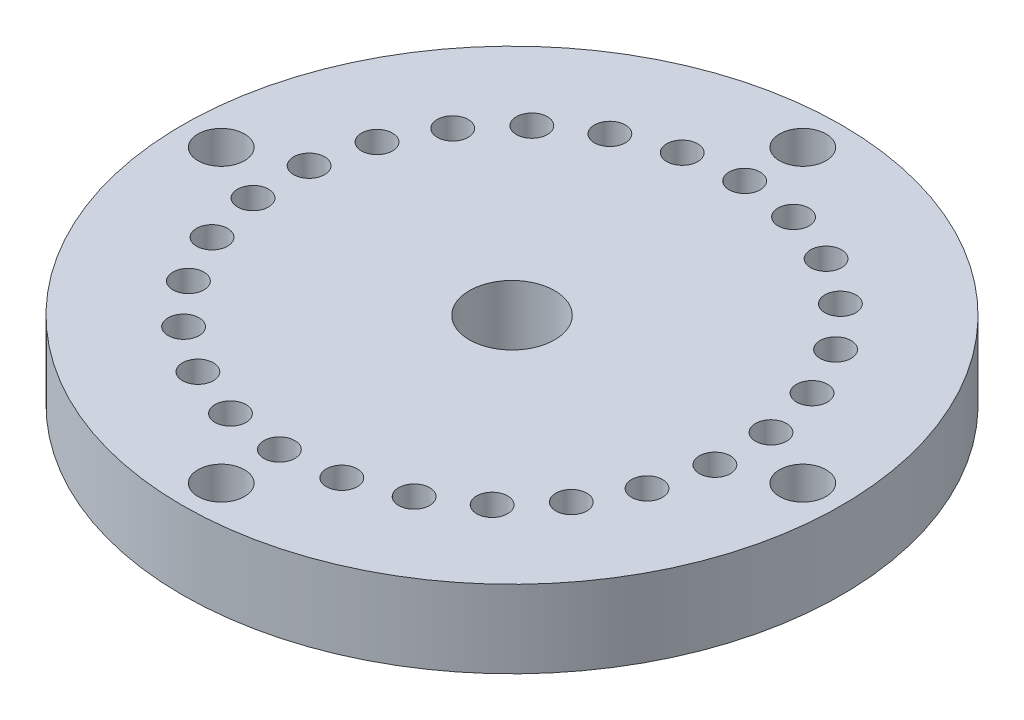
ISO-10303-21;
HEADER;
FILE_DESCRIPTION(('STEP AP214'),'2;1');
FILE_NAME('part.step','',(''),(''),'','','');
FILE_SCHEMA(('AUTOMOTIVE_DESIGN { 1 0 10303 214 1 1 1 1 }'));
ENDSEC;
DATA;
#1=APPLICATION_CONTEXT('core data for automotive mechanical design processes');
#2=APPLICATION_PROTOCOL_DEFINITION('international standard','automotive_design',2000,#1);
#3=PRODUCT_CONTEXT('',#1,'mechanical');
#4=PRODUCT('Part','Part','',(#3));
#5=PRODUCT_RELATED_PRODUCT_CATEGORY('part','',(#4));
#6=PRODUCT_DEFINITION_FORMATION('','',#4);
#7=PRODUCT_DEFINITION_CONTEXT('part definition',#1,'design');
#8=PRODUCT_DEFINITION('design','',#6,#7);
#9=PRODUCT_DEFINITION_SHAPE('','',#8);
#10=(LENGTH_UNIT() NAMED_UNIT(*) SI_UNIT(.MILLI.,.METRE.));
#11=(NAMED_UNIT(*) PLANE_ANGLE_UNIT() SI_UNIT($,.RADIAN.));
#12=(NAMED_UNIT(*) SI_UNIT($,.STERADIAN.) SOLID_ANGLE_UNIT());
#13=UNCERTAINTY_MEASURE_WITH_UNIT(LENGTH_MEASURE(1.E-05),#10,'distance_accuracy_value','');
#14=(GEOMETRIC_REPRESENTATION_CONTEXT(3) GLOBAL_UNCERTAINTY_ASSIGNED_CONTEXT((#13)) GLOBAL_UNIT_ASSIGNED_CONTEXT((#10,
#11,#12)) REPRESENTATION_CONTEXT('',''));
#15=CARTESIAN_POINT('',(0.,0.,0.));
#16=DIRECTION('',(0.,0.,1.));
#17=DIRECTION('',(1.,0.,0.));
#18=AXIS2_PLACEMENT_3D('',#15,#16,#17);
#19=CARTESIAN_POINT('',(0.,1.,0.));
#20=DIRECTION('',(0.,1.,0.));
#21=DIRECTION('',(0.,0.,1.));
#22=AXIS2_PLACEMENT_3D('',#19,#20,#21);
#23=PLANE('',#22);
#24=CARTESIAN_POINT('',(2.1224433562867E-13,1.,3.75));
#25=DIRECTION('',(0.,1.,0.));
#26=DIRECTION('',(0.,0.,1.));
#27=AXIS2_PLACEMENT_3D('',#24,#25,#26);
#28=CIRCLE('',#27,0.300000000000228);
#29=CARTESIAN_POINT('',(2.1224433562867E-13,1.,4.05000000000023));
#30=VERTEX_POINT('',#29);
#31=EDGE_CURVE('E214',#30,#30,#28,.T.);
#32=ORIENTED_EDGE('',*,*,#31,.F.);
#33=EDGE_LOOP('',(#32));
#34=FACE_BOUND('',#33,.T.);
#35=CARTESIAN_POINT('',(-0.717946992862634,1.,-2.91282545227817));
#36=DIRECTION('',(0.,1.,0.));
#37=DIRECTION('',(0.,0.,1.));
#38=AXIS2_PLACEMENT_3D('',#35,#36,#37);
#39=CIRCLE('',#38,0.2);
#40=CARTESIAN_POINT('',(-0.717946992862634,1.,-2.71282545227817));
#41=VERTEX_POINT('',#40);
#42=EDGE_CURVE('E202',#41,#41,#39,.T.);
#43=ORIENTED_EDGE('',*,*,#42,.F.);
#44=EDGE_LOOP('',(#43));
#45=FACE_BOUND('',#44,.T.);
#46=CARTESIAN_POINT('',(-1.98936797472234,1.,-2.24553224451319));
#47=DIRECTION('',(0.,1.,0.));
#48=DIRECTION('',(0.,0.,1.));
#49=AXIS2_PLACEMENT_3D('',#46,#47,#48);
#50=CIRCLE('',#49,0.20000000000011);
#51=CARTESIAN_POINT('',(-1.98936797472234,1.,-2.04553224451308));
#52=VERTEX_POINT('',#51);
#53=EDGE_CURVE('E190',#52,#52,#50,.T.);
#54=ORIENTED_EDGE('',*,*,#53,.F.);
#55=EDGE_LOOP('',(#54));
#56=FACE_BOUND('',#55,.T.);
#57=CARTESIAN_POINT('',(-2.80504872805614,1.,-1.06381466112745));
#58=DIRECTION('',(0.,1.,0.));
#59=DIRECTION('',(0.,0.,1.));
#60=AXIS2_PLACEMENT_3D('',#57,#58,#59);
#61=CIRCLE('',#60,0.200000000000185);
#62=CARTESIAN_POINT('',(-2.80504872805614,1.,-0.863814661127263));
#63=VERTEX_POINT('',#62);
#64=EDGE_CURVE('E178',#63,#63,#61,.T.);
#65=ORIENTED_EDGE('',*,*,#64,.F.);
#66=EDGE_LOOP('',(#65));
#67=FACE_BOUND('',#66,.T.);
#68=CARTESIAN_POINT('',(-2.97812662229397,1.,0.36161004076614));
#69=DIRECTION('',(0.,1.,0.));
#70=DIRECTION('',(0.,0.,1.));
#71=AXIS2_PLACEMENT_3D('',#68,#69,#70);
#72=CIRCLE('',#71,0.200000000000262);
#73=CARTESIAN_POINT('',(-2.97812662229397,1.,0.561610040766402));
#74=VERTEX_POINT('',#73);
#75=EDGE_CURVE('E166',#74,#74,#72,.T.);
#76=ORIENTED_EDGE('',*,*,#75,.F.);
#77=EDGE_LOOP('',(#76));
#78=FACE_BOUND('',#77,.T.);
#79=CARTESIAN_POINT('',(-2.4689515976807,1.,1.70419424019361));
#80=DIRECTION('',(0.,1.,0.));
#81=DIRECTION('',(0.,0.,1.));
#82=AXIS2_PLACEMENT_3D('',#79,#80,#81);
#83=CIRCLE('',#82,0.200000000000322);
#84=CARTESIAN_POINT('',(-2.4689515976807,1.,1.90419424019393));
#85=VERTEX_POINT('',#84);
#86=EDGE_CURVE('E154',#85,#85,#83,.T.);
#87=ORIENTED_EDGE('',*,*,#86,.F.);
#88=EDGE_LOOP('',(#87));
#89=FACE_BOUND('',#88,.T.);
#90=CARTESIAN_POINT('',(-1.39416951613099,1.,2.65636807695971));
#91=DIRECTION('',(0.,1.,0.));
#92=DIRECTION('',(0.,0.,1.));
#93=AXIS2_PLACEMENT_3D('',#90,#91,#92);
#94=CIRCLE('',#93,0.200000000000352);
#95=CARTESIAN_POINT('',(-1.39416951613099,1.,2.85636807696006));
#96=VERTEX_POINT('',#95);
#97=EDGE_CURVE('E142',#96,#96,#94,.T.);
#98=ORIENTED_EDGE('',*,*,#97,.F.);
#99=EDGE_LOOP('',(#98));
#100=FACE_BOUND('',#99,.T.);
#101=CARTESIAN_POINT('',(3.4032572508536E-13,1.,3.));
#102=DIRECTION('',(0.,1.,0.));
#103=DIRECTION('',(0.,0.,1.));
#104=AXIS2_PLACEMENT_3D('',#101,#102,#103);
#105=CIRCLE('',#104,0.200000000000346);
#106=CARTESIAN_POINT('',(3.4032572508536E-13,1.,3.20000000000035));
#107=VERTEX_POINT('',#106);
#108=EDGE_CURVE('E130',#107,#107,#105,.T.);
#109=ORIENTED_EDGE('',*,*,#108,.F.);
#110=EDGE_LOOP('',(#109));
#111=FACE_BOUND('',#110,.T.);
#112=CARTESIAN_POINT('',(1.39416951613163,1.,2.65636807695955));
#113=DIRECTION('',(0.,1.,0.));
#114=DIRECTION('',(0.,0.,1.));
#115=AXIS2_PLACEMENT_3D('',#112,#113,#114);
#116=CIRCLE('',#115,0.200000000000302);
#117=CARTESIAN_POINT('',(1.39416951613163,1.,2.85636807695985));
#118=VERTEX_POINT('',#117);
#119=EDGE_CURVE('E118',#118,#118,#116,.T.);
#120=ORIENTED_EDGE('',*,*,#119,.F.);
#121=EDGE_LOOP('',(#120));
#122=FACE_BOUND('',#121,.T.);
#123=CARTESIAN_POINT('',(2.46895159768124,1.,1.70419424019333));
#124=DIRECTION('',(0.,1.,0.));
#125=DIRECTION('',(0.,0.,1.));
#126=AXIS2_PLACEMENT_3D('',#123,#124,#125);
#127=CIRCLE('',#126,0.200000000000228);
#128=CARTESIAN_POINT('',(2.46895159768124,1.,1.90419424019356));
#129=VERTEX_POINT('',#128);
#130=EDGE_CURVE('E106',#129,#129,#127,.T.);
#131=ORIENTED_EDGE('',*,*,#130,.F.);
#132=EDGE_LOOP('',(#131));
#133=FACE_BOUND('',#132,.T.);
#134=CARTESIAN_POINT('',(2.97812662229435,1.,0.3616100407658));
#135=DIRECTION('',(0.,1.,0.));
#136=DIRECTION('',(0.,0.,1.));
#137=AXIS2_PLACEMENT_3D('',#134,#135,#136);
#138=CIRCLE('',#137,0.200000000000144);
#139=CARTESIAN_POINT('',(2.97812662229435,1.,0.561610040765944));
#140=VERTEX_POINT('',#139);
#141=EDGE_CURVE('E94',#140,#140,#138,.T.);
#142=ORIENTED_EDGE('',*,*,#141,.F.);
#143=EDGE_LOOP('',(#142));
#144=FACE_BOUND('',#143,.T.);
#145=CARTESIAN_POINT('',(2.80504872805635,1.,-1.06381466112777));
#146=DIRECTION('',(0.,1.,0.));
#147=DIRECTION('',(0.,0.,1.));
#148=AXIS2_PLACEMENT_3D('',#145,#146,#147);
#149=CIRCLE('',#148,0.200000000000066);
#150=CARTESIAN_POINT('',(2.80504872805635,1.,-0.8638146611277));
#151=VERTEX_POINT('',#150);
#152=EDGE_CURVE('E82',#151,#151,#149,.T.);
#153=ORIENTED_EDGE('',*,*,#152,.F.);
#154=EDGE_LOOP('',(#153));
#155=FACE_BOUND('',#154,.T.);
#156=CARTESIAN_POINT('',(1.98936797472243,1.,-2.24553224451342));
#157=DIRECTION('',(0.,1.,0.));
#158=DIRECTION('',(0.,0.,1.));
#159=AXIS2_PLACEMENT_3D('',#156,#157,#158);
#160=CIRCLE('',#159,0.200000000000013);
#161=CARTESIAN_POINT('',(1.98936797472243,1.,-2.0455322445134));
#162=VERTEX_POINT('',#161);
#163=EDGE_CURVE('E70',#162,#162,#160,.T.);
#164=ORIENTED_EDGE('',*,*,#163,.F.);
#165=EDGE_LOOP('',(#164));
#166=FACE_BOUND('',#165,.T.);
#167=CARTESIAN_POINT('',(0.717946992862675,1.,-2.91282545227816));
#168=DIRECTION('',(0.,1.,0.));
#169=DIRECTION('',(0.,0.,1.));
#170=AXIS2_PLACEMENT_3D('',#167,#168,#169);
#171=CIRCLE('',#170,0.2);
#172=CARTESIAN_POINT('',(0.717946992862675,1.,-2.71282545227816));
#173=VERTEX_POINT('',#172);
#174=EDGE_CURVE('E58',#173,#173,#171,.T.);
#175=ORIENTED_EDGE('',*,*,#174,.F.);
#176=EDGE_LOOP('',(#175));
#177=FACE_BOUND('',#176,.T.);
#178=CARTESIAN_POINT('',(0.,1.,-3.75));
#179=DIRECTION('',(0.,1.,0.));
#180=DIRECTION('',(0.,0.,1.));
#181=AXIS2_PLACEMENT_3D('',#178,#179,#180);
#182=CIRCLE('',#181,0.3);
#183=CARTESIAN_POINT('',(0.,1.,-3.45));
#184=VERTEX_POINT('',#183);
#185=EDGE_CURVE('E46',#184,#184,#182,.T.);
#186=ORIENTED_EDGE('',*,*,#185,.F.);
#187=EDGE_LOOP('',(#186));
#188=FACE_BOUND('',#187,.T.);
#189=CARTESIAN_POINT('',(0.,1.,0.));
#190=DIRECTION('',(0.,1.,0.));
#191=DIRECTION('',(0.,0.,1.));
#192=AXIS2_PLACEMENT_3D('',#189,#190,#191);
#193=CIRCLE('',#192,4.25);
#194=CARTESIAN_POINT('',(0.,1.,4.25));
#195=VERTEX_POINT('',#194);
#196=EDGE_CURVE('E10',#195,#195,#193,.T.);
#197=ORIENTED_EDGE('',*,*,#196,.T.);
#198=EDGE_LOOP('',(#197));
#199=FACE_BOUND('',#198,.T.);
#200=CARTESIAN_POINT('',(0.,1.,0.));
#201=DIRECTION('',(0.,1.,0.));
#202=DIRECTION('',(0.,0.,1.));
#203=AXIS2_PLACEMENT_3D('',#200,#201,#202);
#204=CIRCLE('',#203,0.55);
#205=CARTESIAN_POINT('',(0.,1.,0.55));
#206=VERTEX_POINT('',#205);
#207=EDGE_CURVE('E41',#206,#206,#204,.T.);
#208=ORIENTED_EDGE('',*,*,#207,.F.);
#209=EDGE_LOOP('',(#208));
#210=FACE_BOUND('',#209,.T.);
#211=CARTESIAN_POINT('',(0.,1.,-3.));
#212=DIRECTION('',(0.,1.,0.));
#213=DIRECTION('',(0.,0.,1.));
#214=AXIS2_PLACEMENT_3D('',#211,#212,#213);
#215=CIRCLE('',#214,0.2);
#216=CARTESIAN_POINT('',(0.,1.,-2.8));
#217=VERTEX_POINT('',#216);
#218=EDGE_CURVE('E52',#217,#217,#215,.T.);
#219=ORIENTED_EDGE('',*,*,#218,.F.);
#220=EDGE_LOOP('',(#219));
#221=FACE_BOUND('',#220,.T.);
#222=CARTESIAN_POINT('',(1.39416951613133,1.,-2.65636807695971));
#223=DIRECTION('',(0.,1.,0.));
#224=DIRECTION('',(0.,0.,1.));
#225=AXIS2_PLACEMENT_3D('',#222,#223,#224);
#226=CIRCLE('',#225,0.199999999999999);
#227=CARTESIAN_POINT('',(1.39416951613133,1.,-2.45636807695971));
#228=VERTEX_POINT('',#227);
#229=EDGE_CURVE('E64',#228,#228,#226,.T.);
#230=ORIENTED_EDGE('',*,*,#229,.F.);
#231=EDGE_LOOP('',(#230));
#232=FACE_BOUND('',#231,.T.);
#233=CARTESIAN_POINT('',(2.46895159768104,1.,-1.70419424019361));
#234=DIRECTION('',(0.,1.,0.));
#235=DIRECTION('',(0.,0.,1.));
#236=AXIS2_PLACEMENT_3D('',#233,#234,#235);
#237=CIRCLE('',#236,0.200000000000036);
#238=CARTESIAN_POINT('',(2.46895159768104,1.,-1.50419424019357));
#239=VERTEX_POINT('',#238);
#240=EDGE_CURVE('E76',#239,#239,#237,.T.);
#241=ORIENTED_EDGE('',*,*,#240,.F.);
#242=EDGE_LOOP('',(#241));
#243=FACE_BOUND('',#242,.T.);
#244=CARTESIAN_POINT('',(2.97812662229431,1.,-0.361610040766138));
#245=DIRECTION('',(0.,1.,0.));
#246=DIRECTION('',(0.,0.,1.));
#247=AXIS2_PLACEMENT_3D('',#244,#245,#246);
#248=CIRCLE('',#247,0.200000000000103);
#249=CARTESIAN_POINT('',(2.97812662229431,1.,-0.161610040766035));
#250=VERTEX_POINT('',#249);
#251=EDGE_CURVE('E88',#250,#250,#248,.T.);
#252=ORIENTED_EDGE('',*,*,#251,.F.);
#253=EDGE_LOOP('',(#252));
#254=FACE_BOUND('',#253,.T.);
#255=CARTESIAN_POINT('',(2.80504872805647,1.,1.06381466112745));
#256=DIRECTION('',(0.,1.,0.));
#257=DIRECTION('',(0.,0.,1.));
#258=AXIS2_PLACEMENT_3D('',#255,#256,#257);
#259=CIRCLE('',#258,0.200000000000187);
#260=CARTESIAN_POINT('',(2.80504872805647,1.,1.26381466112763));
#261=VERTEX_POINT('',#260);
#262=EDGE_CURVE('E100',#261,#261,#259,.T.);
#263=ORIENTED_EDGE('',*,*,#262,.F.);
#264=EDGE_LOOP('',(#263));
#265=FACE_BOUND('',#264,.T.);
#266=CARTESIAN_POINT('',(1.98936797472268,1.,2.24553224451319));
#267=DIRECTION('',(0.,1.,0.));
#268=DIRECTION('',(0.,0.,1.));
#269=AXIS2_PLACEMENT_3D('',#266,#267,#268);
#270=CIRCLE('',#269,0.200000000000268);
#271=CARTESIAN_POINT('',(1.98936797472268,1.,2.44553224451346));
#272=VERTEX_POINT('',#271);
#273=EDGE_CURVE('E112',#272,#272,#270,.T.);
#274=ORIENTED_EDGE('',*,*,#273,.F.);
#275=EDGE_LOOP('',(#274));
#276=FACE_BOUND('',#275,.T.);
#277=CARTESIAN_POINT('',(0.717946992863009,1.,2.91282545227812));
#278=DIRECTION('',(0.,1.,0.));
#279=DIRECTION('',(0.,0.,1.));
#280=AXIS2_PLACEMENT_3D('',#277,#278,#279);
#281=CIRCLE('',#280,0.200000000000327);
#282=CARTESIAN_POINT('',(0.717946992863009,1.,3.11282545227844));
#283=VERTEX_POINT('',#282);
#284=EDGE_CURVE('E124',#283,#283,#281,.T.);
#285=ORIENTED_EDGE('',*,*,#284,.F.);
#286=EDGE_LOOP('',(#285));
#287=FACE_BOUND('',#286,.T.);
#288=CARTESIAN_POINT('',(-0.717946992862337,1.,2.9128254522782));
#289=DIRECTION('',(0.,1.,0.));
#290=DIRECTION('',(0.,0.,1.));
#291=AXIS2_PLACEMENT_3D('',#288,#289,#290);
#292=CIRCLE('',#291,0.200000000000355);
#293=CARTESIAN_POINT('',(-0.717946992862337,1.,3.11282545227855));
#294=VERTEX_POINT('',#293);
#295=EDGE_CURVE('E136',#294,#294,#292,.T.);
#296=ORIENTED_EDGE('',*,*,#295,.F.);
#297=EDGE_LOOP('',(#296));
#298=FACE_BOUND('',#297,.T.);
#299=CARTESIAN_POINT('',(-1.98936797472209,1.,2.24553224451342));
#300=DIRECTION('',(0.,1.,0.));
#301=DIRECTION('',(0.,0.,1.));
#302=AXIS2_PLACEMENT_3D('',#299,#300,#301);
#303=CIRCLE('',#302,0.200000000000342);
#304=CARTESIAN_POINT('',(-1.98936797472209,1.,2.44553224451376));
#305=VERTEX_POINT('',#304);
#306=EDGE_CURVE('E148',#305,#305,#303,.T.);
#307=ORIENTED_EDGE('',*,*,#306,.F.);
#308=EDGE_LOOP('',(#307));
#309=FACE_BOUND('',#308,.T.);
#310=CARTESIAN_POINT('',(-2.80504872805601,1.,1.06381466112777));
#311=DIRECTION('',(0.,1.,0.));
#312=DIRECTION('',(0.,0.,1.));
#313=AXIS2_PLACEMENT_3D('',#310,#311,#312);
#314=CIRCLE('',#313,0.200000000000295);
#315=CARTESIAN_POINT('',(-2.80504872805601,1.,1.26381466112806));
#316=VERTEX_POINT('',#315);
#317=EDGE_CURVE('E160',#316,#316,#314,.T.);
#318=ORIENTED_EDGE('',*,*,#317,.F.);
#319=EDGE_LOOP('',(#318));
#320=FACE_BOUND('',#319,.T.);
#321=CARTESIAN_POINT('',(-2.97812662229401,1.,-0.361610040765798));
#322=DIRECTION('',(0.,1.,0.));
#323=DIRECTION('',(0.,0.,1.));
#324=AXIS2_PLACEMENT_3D('',#321,#322,#323);
#325=CIRCLE('',#324,0.200000000000225);
#326=CARTESIAN_POINT('',(-2.97812662229401,1.,-0.161610040765573));
#327=VERTEX_POINT('',#326);
#328=EDGE_CURVE('E172',#327,#327,#325,.T.);
#329=ORIENTED_EDGE('',*,*,#328,.F.);
#330=EDGE_LOOP('',(#329));
#331=FACE_BOUND('',#330,.T.);
#332=CARTESIAN_POINT('',(-2.4689515976809,1.,-1.70419424019333));
#333=DIRECTION('',(0.,1.,0.));
#334=DIRECTION('',(0.,0.,1.));
#335=AXIS2_PLACEMENT_3D('',#332,#333,#334);
#336=CIRCLE('',#335,0.200000000000147);
#337=CARTESIAN_POINT('',(-2.4689515976809,1.,-1.50419424019318));
#338=VERTEX_POINT('',#337);
#339=EDGE_CURVE('E184',#338,#338,#336,.T.);
#340=ORIENTED_EDGE('',*,*,#339,.F.);
#341=EDGE_LOOP('',(#340));
#342=FACE_BOUND('',#341,.T.);
#343=CARTESIAN_POINT('',(-1.39416951613129,1.,-2.65636807695955));
#344=DIRECTION('',(0.,1.,0.));
#345=DIRECTION('',(0.,0.,1.));
#346=AXIS2_PLACEMENT_3D('',#343,#344,#345);
#347=CIRCLE('',#346,0.20000000000008);
#348=CARTESIAN_POINT('',(-1.39416951613129,1.,-2.45636807695947));
#349=VERTEX_POINT('',#348);
#350=EDGE_CURVE('E196',#349,#349,#347,.T.);
#351=ORIENTED_EDGE('',*,*,#350,.F.);
#352=EDGE_LOOP('',(#351));
#353=FACE_BOUND('',#352,.T.);
#354=CARTESIAN_POINT('',(3.75000000000011,1.,-1.06122167814335E-13));
#355=DIRECTION('',(0.,1.,0.));
#356=DIRECTION('',(0.,0.,1.));
#357=AXIS2_PLACEMENT_3D('',#354,#355,#356);
#358=CIRCLE('',#357,0.300000000000083);
#359=CARTESIAN_POINT('',(3.75000000000011,1.,0.299999999999977));
#360=VERTEX_POINT('',#359);
#361=EDGE_CURVE('E208',#360,#360,#358,.T.);
#362=ORIENTED_EDGE('',*,*,#361,.F.);
#363=EDGE_LOOP('',(#362));
#364=FACE_BOUND('',#363,.T.);
#365=CARTESIAN_POINT('',(-3.74999999999989,1.,1.06581410364015E-13));
#366=DIRECTION('',(0.,1.,0.));
#367=DIRECTION('',(0.,0.,1.));
#368=AXIS2_PLACEMENT_3D('',#365,#366,#367);
#369=CIRCLE('',#368,0.30000000000017);
#370=CARTESIAN_POINT('',(-3.74999999999989,1.,0.300000000000277));
#371=VERTEX_POINT('',#370);
#372=EDGE_CURVE('E220',#371,#371,#369,.T.);
#373=ORIENTED_EDGE('',*,*,#372,.F.);
#374=EDGE_LOOP('',(#373));
#375=FACE_BOUND('',#374,.T.);
#376=ADVANCED_FACE('F30',(#34,#45,#56,#67,#78,#89,#100,#111,#122,#133,#144,#155,#166,#177,#188,
#199,#210,#221,#232,#243,#254,#265,#276,#287,#298,#309,#320,#331,#342,#353,#364,#375),#23,.T.);
#377=CARTESIAN_POINT('',(0.,0.,0.));
#378=DIRECTION('',(0.,1.,0.));
#379=DIRECTION('',(0.,0.,1.));
#380=AXIS2_PLACEMENT_3D('',#377,#378,#379);
#381=PLANE('',#380);
#382=CARTESIAN_POINT('',(2.1224433562867E-13,0.,3.75));
#383=DIRECTION('',(0.,1.,0.));
#384=DIRECTION('',(0.,0.,1.));
#385=AXIS2_PLACEMENT_3D('',#382,#383,#384);
#386=CIRCLE('',#385,0.300000000000228);
#387=CARTESIAN_POINT('',(2.1224433562867E-13,0.,4.05000000000023));
#388=VERTEX_POINT('',#387);
#389=EDGE_CURVE('E217',#388,#388,#386,.T.);
#390=ORIENTED_EDGE('',*,*,#389,.T.);
#391=EDGE_LOOP('',(#390));
#392=FACE_BOUND('',#391,.T.);
#393=CARTESIAN_POINT('',(-0.717946992862634,0.,-2.91282545227817));
#394=DIRECTION('',(0.,1.,0.));
#395=DIRECTION('',(0.,0.,1.));
#396=AXIS2_PLACEMENT_3D('',#393,#394,#395);
#397=CIRCLE('',#396,0.2);
#398=CARTESIAN_POINT('',(-0.717946992862634,0.,-2.71282545227817));
#399=VERTEX_POINT('',#398);
#400=EDGE_CURVE('E205',#399,#399,#397,.T.);
#401=ORIENTED_EDGE('',*,*,#400,.T.);
#402=EDGE_LOOP('',(#401));
#403=FACE_BOUND('',#402,.T.);
#404=CARTESIAN_POINT('',(-1.98936797472234,0.,-2.24553224451319));
#405=DIRECTION('',(0.,1.,0.));
#406=DIRECTION('',(0.,0.,1.));
#407=AXIS2_PLACEMENT_3D('',#404,#405,#406);
#408=CIRCLE('',#407,0.20000000000011);
#409=CARTESIAN_POINT('',(-1.98936797472234,0.,-2.04553224451308));
#410=VERTEX_POINT('',#409);
#411=EDGE_CURVE('E193',#410,#410,#408,.T.);
#412=ORIENTED_EDGE('',*,*,#411,.T.);
#413=EDGE_LOOP('',(#412));
#414=FACE_BOUND('',#413,.T.);
#415=CARTESIAN_POINT('',(-2.80504872805614,0.,-1.06381466112745));
#416=DIRECTION('',(0.,1.,0.));
#417=DIRECTION('',(0.,0.,1.));
#418=AXIS2_PLACEMENT_3D('',#415,#416,#417);
#419=CIRCLE('',#418,0.200000000000185);
#420=CARTESIAN_POINT('',(-2.80504872805614,0.,-0.863814661127263));
#421=VERTEX_POINT('',#420);
#422=EDGE_CURVE('E181',#421,#421,#419,.T.);
#423=ORIENTED_EDGE('',*,*,#422,.T.);
#424=EDGE_LOOP('',(#423));
#425=FACE_BOUND('',#424,.T.);
#426=CARTESIAN_POINT('',(-2.97812662229397,0.,0.36161004076614));
#427=DIRECTION('',(0.,1.,0.));
#428=DIRECTION('',(0.,0.,1.));
#429=AXIS2_PLACEMENT_3D('',#426,#427,#428);
#430=CIRCLE('',#429,0.200000000000262);
#431=CARTESIAN_POINT('',(-2.97812662229397,0.,0.561610040766402));
#432=VERTEX_POINT('',#431);
#433=EDGE_CURVE('E169',#432,#432,#430,.T.);
#434=ORIENTED_EDGE('',*,*,#433,.T.);
#435=EDGE_LOOP('',(#434));
#436=FACE_BOUND('',#435,.T.);
#437=CARTESIAN_POINT('',(-2.4689515976807,0.,1.70419424019361));
#438=DIRECTION('',(0.,1.,0.));
#439=DIRECTION('',(0.,0.,1.));
#440=AXIS2_PLACEMENT_3D('',#437,#438,#439);
#441=CIRCLE('',#440,0.200000000000322);
#442=CARTESIAN_POINT('',(-2.4689515976807,0.,1.90419424019393));
#443=VERTEX_POINT('',#442);
#444=EDGE_CURVE('E157',#443,#443,#441,.T.);
#445=ORIENTED_EDGE('',*,*,#444,.T.);
#446=EDGE_LOOP('',(#445));
#447=FACE_BOUND('',#446,.T.);
#448=CARTESIAN_POINT('',(-1.39416951613099,0.,2.65636807695971));
#449=DIRECTION('',(0.,1.,0.));
#450=DIRECTION('',(0.,0.,1.));
#451=AXIS2_PLACEMENT_3D('',#448,#449,#450);
#452=CIRCLE('',#451,0.200000000000352);
#453=CARTESIAN_POINT('',(-1.39416951613099,0.,2.85636807696006));
#454=VERTEX_POINT('',#453);
#455=EDGE_CURVE('E145',#454,#454,#452,.T.);
#456=ORIENTED_EDGE('',*,*,#455,.T.);
#457=EDGE_LOOP('',(#456));
#458=FACE_BOUND('',#457,.T.);
#459=CARTESIAN_POINT('',(3.4032572508536E-13,0.,3.));
#460=DIRECTION('',(0.,1.,0.));
#461=DIRECTION('',(0.,0.,1.));
#462=AXIS2_PLACEMENT_3D('',#459,#460,#461);
#463=CIRCLE('',#462,0.200000000000346);
#464=CARTESIAN_POINT('',(3.4032572508536E-13,0.,3.20000000000035));
#465=VERTEX_POINT('',#464);
#466=EDGE_CURVE('E133',#465,#465,#463,.T.);
#467=ORIENTED_EDGE('',*,*,#466,.T.);
#468=EDGE_LOOP('',(#467));
#469=FACE_BOUND('',#468,.T.);
#470=CARTESIAN_POINT('',(1.39416951613163,0.,2.65636807695955));
#471=DIRECTION('',(0.,1.,0.));
#472=DIRECTION('',(0.,0.,1.));
#473=AXIS2_PLACEMENT_3D('',#470,#471,#472);
#474=CIRCLE('',#473,0.200000000000302);
#475=CARTESIAN_POINT('',(1.39416951613163,0.,2.85636807695985));
#476=VERTEX_POINT('',#475);
#477=EDGE_CURVE('E121',#476,#476,#474,.T.);
#478=ORIENTED_EDGE('',*,*,#477,.T.);
#479=EDGE_LOOP('',(#478));
#480=FACE_BOUND('',#479,.T.);
#481=CARTESIAN_POINT('',(2.46895159768124,0.,1.70419424019333));
#482=DIRECTION('',(0.,1.,0.));
#483=DIRECTION('',(0.,0.,1.));
#484=AXIS2_PLACEMENT_3D('',#481,#482,#483);
#485=CIRCLE('',#484,0.200000000000228);
#486=CARTESIAN_POINT('',(2.46895159768124,0.,1.90419424019356));
#487=VERTEX_POINT('',#486);
#488=EDGE_CURVE('E109',#487,#487,#485,.T.);
#489=ORIENTED_EDGE('',*,*,#488,.T.);
#490=EDGE_LOOP('',(#489));
#491=FACE_BOUND('',#490,.T.);
#492=CARTESIAN_POINT('',(2.97812662229435,0.,0.3616100407658));
#493=DIRECTION('',(0.,1.,0.));
#494=DIRECTION('',(0.,0.,1.));
#495=AXIS2_PLACEMENT_3D('',#492,#493,#494);
#496=CIRCLE('',#495,0.200000000000144);
#497=CARTESIAN_POINT('',(2.97812662229435,0.,0.561610040765944));
#498=VERTEX_POINT('',#497);
#499=EDGE_CURVE('E97',#498,#498,#496,.T.);
#500=ORIENTED_EDGE('',*,*,#499,.T.);
#501=EDGE_LOOP('',(#500));
#502=FACE_BOUND('',#501,.T.);
#503=CARTESIAN_POINT('',(2.80504872805635,0.,-1.06381466112777));
#504=DIRECTION('',(0.,1.,0.));
#505=DIRECTION('',(0.,0.,1.));
#506=AXIS2_PLACEMENT_3D('',#503,#504,#505);
#507=CIRCLE('',#506,0.200000000000066);
#508=CARTESIAN_POINT('',(2.80504872805635,0.,-0.8638146611277));
#509=VERTEX_POINT('',#508);
#510=EDGE_CURVE('E85',#509,#509,#507,.T.);
#511=ORIENTED_EDGE('',*,*,#510,.T.);
#512=EDGE_LOOP('',(#511));
#513=FACE_BOUND('',#512,.T.);
#514=CARTESIAN_POINT('',(1.98936797472243,0.,-2.24553224451342));
#515=DIRECTION('',(0.,1.,0.));
#516=DIRECTION('',(0.,0.,1.));
#517=AXIS2_PLACEMENT_3D('',#514,#515,#516);
#518=CIRCLE('',#517,0.200000000000013);
#519=CARTESIAN_POINT('',(1.98936797472243,0.,-2.0455322445134));
#520=VERTEX_POINT('',#519);
#521=EDGE_CURVE('E73',#520,#520,#518,.T.);
#522=ORIENTED_EDGE('',*,*,#521,.T.);
#523=EDGE_LOOP('',(#522));
#524=FACE_BOUND('',#523,.T.);
#525=CARTESIAN_POINT('',(0.717946992862675,0.,-2.91282545227816));
#526=DIRECTION('',(0.,1.,0.));
#527=DIRECTION('',(0.,0.,1.));
#528=AXIS2_PLACEMENT_3D('',#525,#526,#527);
#529=CIRCLE('',#528,0.2);
#530=CARTESIAN_POINT('',(0.717946992862675,0.,-2.71282545227816));
#531=VERTEX_POINT('',#530);
#532=EDGE_CURVE('E61',#531,#531,#529,.T.);
#533=ORIENTED_EDGE('',*,*,#532,.T.);
#534=EDGE_LOOP('',(#533));
#535=FACE_BOUND('',#534,.T.);
#536=CARTESIAN_POINT('',(0.,0.,-3.75));
#537=DIRECTION('',(0.,1.,0.));
#538=DIRECTION('',(0.,0.,1.));
#539=AXIS2_PLACEMENT_3D('',#536,#537,#538);
#540=CIRCLE('',#539,0.3);
#541=CARTESIAN_POINT('',(0.,0.,-3.45));
#542=VERTEX_POINT('',#541);
#543=EDGE_CURVE('E49',#542,#542,#540,.T.);
#544=ORIENTED_EDGE('',*,*,#543,.T.);
#545=EDGE_LOOP('',(#544));
#546=FACE_BOUND('',#545,.T.);
#547=CARTESIAN_POINT('',(0.,0.,0.));
#548=DIRECTION('',(0.,1.,0.));
#549=DIRECTION('',(0.,0.,1.));
#550=AXIS2_PLACEMENT_3D('',#547,#548,#549);
#551=CIRCLE('',#550,4.25);
#552=CARTESIAN_POINT('',(0.,0.,4.25));
#553=VERTEX_POINT('',#552);
#554=EDGE_CURVE('E34',#553,#553,#551,.T.);
#555=ORIENTED_EDGE('',*,*,#554,.F.);
#556=EDGE_LOOP('',(#555));
#557=FACE_BOUND('',#556,.T.);
#558=CARTESIAN_POINT('',(0.,0.,0.));
#559=DIRECTION('',(0.,1.,0.));
#560=DIRECTION('',(0.,0.,1.));
#561=AXIS2_PLACEMENT_3D('',#558,#559,#560);
#562=CIRCLE('',#561,0.55);
#563=CARTESIAN_POINT('',(0.,0.,0.55));
#564=VERTEX_POINT('',#563);
#565=EDGE_CURVE('E43',#564,#564,#562,.T.);
#566=ORIENTED_EDGE('',*,*,#565,.T.);
#567=EDGE_LOOP('',(#566));
#568=FACE_BOUND('',#567,.T.);
#569=CARTESIAN_POINT('',(0.,0.,-3.));
#570=DIRECTION('',(0.,1.,0.));
#571=DIRECTION('',(0.,0.,1.));
#572=AXIS2_PLACEMENT_3D('',#569,#570,#571);
#573=CIRCLE('',#572,0.2);
#574=CARTESIAN_POINT('',(0.,0.,-2.8));
#575=VERTEX_POINT('',#574);
#576=EDGE_CURVE('E55',#575,#575,#573,.T.);
#577=ORIENTED_EDGE('',*,*,#576,.T.);
#578=EDGE_LOOP('',(#577));
#579=FACE_BOUND('',#578,.T.);
#580=CARTESIAN_POINT('',(1.39416951613133,0.,-2.65636807695971));
#581=DIRECTION('',(0.,1.,0.));
#582=DIRECTION('',(0.,0.,1.));
#583=AXIS2_PLACEMENT_3D('',#580,#581,#582);
#584=CIRCLE('',#583,0.199999999999999);
#585=CARTESIAN_POINT('',(1.39416951613133,0.,-2.45636807695971));
#586=VERTEX_POINT('',#585);
#587=EDGE_CURVE('E67',#586,#586,#584,.T.);
#588=ORIENTED_EDGE('',*,*,#587,.T.);
#589=EDGE_LOOP('',(#588));
#590=FACE_BOUND('',#589,.T.);
#591=CARTESIAN_POINT('',(2.46895159768104,0.,-1.70419424019361));
#592=DIRECTION('',(0.,1.,0.));
#593=DIRECTION('',(0.,0.,1.));
#594=AXIS2_PLACEMENT_3D('',#591,#592,#593);
#595=CIRCLE('',#594,0.200000000000036);
#596=CARTESIAN_POINT('',(2.46895159768104,0.,-1.50419424019357));
#597=VERTEX_POINT('',#596);
#598=EDGE_CURVE('E79',#597,#597,#595,.T.);
#599=ORIENTED_EDGE('',*,*,#598,.T.);
#600=EDGE_LOOP('',(#599));
#601=FACE_BOUND('',#600,.T.);
#602=CARTESIAN_POINT('',(2.97812662229431,0.,-0.361610040766138));
#603=DIRECTION('',(0.,1.,0.));
#604=DIRECTION('',(0.,0.,1.));
#605=AXIS2_PLACEMENT_3D('',#602,#603,#604);
#606=CIRCLE('',#605,0.200000000000103);
#607=CARTESIAN_POINT('',(2.97812662229431,0.,-0.161610040766035));
#608=VERTEX_POINT('',#607);
#609=EDGE_CURVE('E91',#608,#608,#606,.T.);
#610=ORIENTED_EDGE('',*,*,#609,.T.);
#611=EDGE_LOOP('',(#610));
#612=FACE_BOUND('',#611,.T.);
#613=CARTESIAN_POINT('',(2.80504872805647,0.,1.06381466112745));
#614=DIRECTION('',(0.,1.,0.));
#615=DIRECTION('',(0.,0.,1.));
#616=AXIS2_PLACEMENT_3D('',#613,#614,#615);
#617=CIRCLE('',#616,0.200000000000187);
#618=CARTESIAN_POINT('',(2.80504872805647,0.,1.26381466112763));
#619=VERTEX_POINT('',#618);
#620=EDGE_CURVE('E103',#619,#619,#617,.T.);
#621=ORIENTED_EDGE('',*,*,#620,.T.);
#622=EDGE_LOOP('',(#621));
#623=FACE_BOUND('',#622,.T.);
#624=CARTESIAN_POINT('',(1.98936797472268,0.,2.24553224451319));
#625=DIRECTION('',(0.,1.,0.));
#626=DIRECTION('',(0.,0.,1.));
#627=AXIS2_PLACEMENT_3D('',#624,#625,#626);
#628=CIRCLE('',#627,0.200000000000268);
#629=CARTESIAN_POINT('',(1.98936797472268,0.,2.44553224451346));
#630=VERTEX_POINT('',#629);
#631=EDGE_CURVE('E115',#630,#630,#628,.T.);
#632=ORIENTED_EDGE('',*,*,#631,.T.);
#633=EDGE_LOOP('',(#632));
#634=FACE_BOUND('',#633,.T.);
#635=CARTESIAN_POINT('',(0.717946992863009,0.,2.91282545227812));
#636=DIRECTION('',(0.,1.,0.));
#637=DIRECTION('',(0.,0.,1.));
#638=AXIS2_PLACEMENT_3D('',#635,#636,#637);
#639=CIRCLE('',#638,0.200000000000327);
#640=CARTESIAN_POINT('',(0.717946992863009,0.,3.11282545227844));
#641=VERTEX_POINT('',#640);
#642=EDGE_CURVE('E127',#641,#641,#639,.T.);
#643=ORIENTED_EDGE('',*,*,#642,.T.);
#644=EDGE_LOOP('',(#643));
#645=FACE_BOUND('',#644,.T.);
#646=CARTESIAN_POINT('',(-0.717946992862337,0.,2.9128254522782));
#647=DIRECTION('',(0.,1.,0.));
#648=DIRECTION('',(0.,0.,1.));
#649=AXIS2_PLACEMENT_3D('',#646,#647,#648);
#650=CIRCLE('',#649,0.200000000000355);
#651=CARTESIAN_POINT('',(-0.717946992862337,0.,3.11282545227855));
#652=VERTEX_POINT('',#651);
#653=EDGE_CURVE('E139',#652,#652,#650,.T.);
#654=ORIENTED_EDGE('',*,*,#653,.T.);
#655=EDGE_LOOP('',(#654));
#656=FACE_BOUND('',#655,.T.);
#657=CARTESIAN_POINT('',(-1.98936797472209,0.,2.24553224451342));
#658=DIRECTION('',(0.,1.,0.));
#659=DIRECTION('',(0.,0.,1.));
#660=AXIS2_PLACEMENT_3D('',#657,#658,#659);
#661=CIRCLE('',#660,0.200000000000342);
#662=CARTESIAN_POINT('',(-1.98936797472209,0.,2.44553224451376));
#663=VERTEX_POINT('',#662);
#664=EDGE_CURVE('E151',#663,#663,#661,.T.);
#665=ORIENTED_EDGE('',*,*,#664,.T.);
#666=EDGE_LOOP('',(#665));
#667=FACE_BOUND('',#666,.T.);
#668=CARTESIAN_POINT('',(-2.80504872805601,0.,1.06381466112777));
#669=DIRECTION('',(0.,1.,0.));
#670=DIRECTION('',(0.,0.,1.));
#671=AXIS2_PLACEMENT_3D('',#668,#669,#670);
#672=CIRCLE('',#671,0.200000000000295);
#673=CARTESIAN_POINT('',(-2.80504872805601,0.,1.26381466112806));
#674=VERTEX_POINT('',#673);
#675=EDGE_CURVE('E163',#674,#674,#672,.T.);
#676=ORIENTED_EDGE('',*,*,#675,.T.);
#677=EDGE_LOOP('',(#676));
#678=FACE_BOUND('',#677,.T.);
#679=CARTESIAN_POINT('',(-2.97812662229401,0.,-0.361610040765798));
#680=DIRECTION('',(0.,1.,0.));
#681=DIRECTION('',(0.,0.,1.));
#682=AXIS2_PLACEMENT_3D('',#679,#680,#681);
#683=CIRCLE('',#682,0.200000000000225);
#684=CARTESIAN_POINT('',(-2.97812662229401,0.,-0.161610040765573));
#685=VERTEX_POINT('',#684);
#686=EDGE_CURVE('E175',#685,#685,#683,.T.);
#687=ORIENTED_EDGE('',*,*,#686,.T.);
#688=EDGE_LOOP('',(#687));
#689=FACE_BOUND('',#688,.T.);
#690=CARTESIAN_POINT('',(-2.4689515976809,0.,-1.70419424019333));
#691=DIRECTION('',(0.,1.,0.));
#692=DIRECTION('',(0.,0.,1.));
#693=AXIS2_PLACEMENT_3D('',#690,#691,#692);
#694=CIRCLE('',#693,0.200000000000147);
#695=CARTESIAN_POINT('',(-2.4689515976809,0.,-1.50419424019318));
#696=VERTEX_POINT('',#695);
#697=EDGE_CURVE('E187',#696,#696,#694,.T.);
#698=ORIENTED_EDGE('',*,*,#697,.T.);
#699=EDGE_LOOP('',(#698));
#700=FACE_BOUND('',#699,.T.);
#701=CARTESIAN_POINT('',(-1.39416951613129,0.,-2.65636807695955));
#702=DIRECTION('',(0.,1.,0.));
#703=DIRECTION('',(0.,0.,1.));
#704=AXIS2_PLACEMENT_3D('',#701,#702,#703);
#705=CIRCLE('',#704,0.20000000000008);
#706=CARTESIAN_POINT('',(-1.39416951613129,0.,-2.45636807695947));
#707=VERTEX_POINT('',#706);
#708=EDGE_CURVE('E199',#707,#707,#705,.T.);
#709=ORIENTED_EDGE('',*,*,#708,.T.);
#710=EDGE_LOOP('',(#709));
#711=FACE_BOUND('',#710,.T.);
#712=CARTESIAN_POINT('',(3.75000000000011,0.,-1.06122167814335E-13));
#713=DIRECTION('',(0.,1.,0.));
#714=DIRECTION('',(0.,0.,1.));
#715=AXIS2_PLACEMENT_3D('',#712,#713,#714);
#716=CIRCLE('',#715,0.300000000000083);
#717=CARTESIAN_POINT('',(3.75000000000011,0.,0.299999999999977));
#718=VERTEX_POINT('',#717);
#719=EDGE_CURVE('E211',#718,#718,#716,.T.);
#720=ORIENTED_EDGE('',*,*,#719,.T.);
#721=EDGE_LOOP('',(#720));
#722=FACE_BOUND('',#721,.T.);
#723=CARTESIAN_POINT('',(-3.74999999999989,0.,1.06581410364015E-13));
#724=DIRECTION('',(0.,1.,0.));
#725=DIRECTION('',(0.,0.,1.));
#726=AXIS2_PLACEMENT_3D('',#723,#724,#725);
#727=CIRCLE('',#726,0.30000000000017);
#728=CARTESIAN_POINT('',(-3.74999999999989,0.,0.300000000000277));
#729=VERTEX_POINT('',#728);
#730=EDGE_CURVE('E223',#729,#729,#727,.T.);
#731=ORIENTED_EDGE('',*,*,#730,.T.);
#732=EDGE_LOOP('',(#731));
#733=FACE_BOUND('',#732,.T.);
#734=ADVANCED_FACE('F233',(#392,#403,#414,#425,#436,#447,#458,#469,#480,#491,#502,#513,#524,
#535,#546,#557,#568,#579,#590,#601,#612,#623,#634,#645,#656,#667,#678,#689,#700,#711,#722,#733),
#381,.F.);
#735=CARTESIAN_POINT('',(0.,1.,0.));
#736=DIRECTION('',(0.,-1.,0.));
#737=DIRECTION('',(0.,0.,-1.));
#738=AXIS2_PLACEMENT_3D('',#735,#736,#737);
#739=CYLINDRICAL_SURFACE('',#738,4.25);
#740=ORIENTED_EDGE('',*,*,#196,.F.);
#741=EDGE_LOOP('',(#740));
#742=FACE_BOUND('',#741,.T.);
#743=ORIENTED_EDGE('',*,*,#554,.T.);
#744=EDGE_LOOP('',(#743));
#745=FACE_BOUND('',#744,.T.);
#746=ADVANCED_FACE('F32',(#742,#745),#739,.T.);
#747=CARTESIAN_POINT('',(0.,1.,0.));
#748=DIRECTION('',(0.,-1.,0.));
#749=DIRECTION('',(0.,0.,-1.));
#750=AXIS2_PLACEMENT_3D('',#747,#748,#749);
#751=CYLINDRICAL_SURFACE('',#750,0.55);
#752=ORIENTED_EDGE('',*,*,#207,.T.);
#753=EDGE_LOOP('',(#752));
#754=FACE_BOUND('',#753,.T.);
#755=ORIENTED_EDGE('',*,*,#565,.F.);
#756=EDGE_LOOP('',(#755));
#757=FACE_BOUND('',#756,.T.);
#758=ADVANCED_FACE('F243',(#754,#757),#751,.F.);
#759=CARTESIAN_POINT('',(0.,1.,-3.75));
#760=DIRECTION('',(0.,-1.,0.));
#761=DIRECTION('',(0.,0.,-1.));
#762=AXIS2_PLACEMENT_3D('',#759,#760,#761);
#763=CYLINDRICAL_SURFACE('',#762,0.3);
#764=ORIENTED_EDGE('',*,*,#185,.T.);
#765=EDGE_LOOP('',(#764));
#766=FACE_BOUND('',#765,.T.);
#767=ORIENTED_EDGE('',*,*,#543,.F.);
#768=EDGE_LOOP('',(#767));
#769=FACE_BOUND('',#768,.T.);
#770=ADVANCED_FACE('F246',(#766,#769),#763,.F.);
#771=CARTESIAN_POINT('',(0.,1.,-3.));
#772=DIRECTION('',(0.,-1.,0.));
#773=DIRECTION('',(0.,0.,-1.));
#774=AXIS2_PLACEMENT_3D('',#771,#772,#773);
#775=CYLINDRICAL_SURFACE('',#774,0.2);
#776=ORIENTED_EDGE('',*,*,#218,.T.);
#777=EDGE_LOOP('',(#776));
#778=FACE_BOUND('',#777,.T.);
#779=ORIENTED_EDGE('',*,*,#576,.F.);
#780=EDGE_LOOP('',(#779));
#781=FACE_BOUND('',#780,.T.);
#782=ADVANCED_FACE('F250',(#778,#781),#775,.F.);
#783=CARTESIAN_POINT('',(0.717946992862675,1.,-2.91282545227816));
#784=DIRECTION('',(0.,-1.,0.));
#785=DIRECTION('',(0.,0.,-1.));
#786=AXIS2_PLACEMENT_3D('',#783,#784,#785);
#787=CYLINDRICAL_SURFACE('',#786,0.2);
#788=ORIENTED_EDGE('',*,*,#174,.T.);
#789=EDGE_LOOP('',(#788));
#790=FACE_BOUND('',#789,.T.);
#791=ORIENTED_EDGE('',*,*,#532,.F.);
#792=EDGE_LOOP('',(#791));
#793=FACE_BOUND('',#792,.T.);
#794=ADVANCED_FACE('F254',(#790,#793),#787,.F.);
#795=CARTESIAN_POINT('',(1.39416951613133,1.,-2.65636807695971));
#796=DIRECTION('',(0.,-1.,0.));
#797=DIRECTION('',(0.,0.,-1.));
#798=AXIS2_PLACEMENT_3D('',#795,#796,#797);
#799=CYLINDRICAL_SURFACE('',#798,0.199999999999999);
#800=ORIENTED_EDGE('',*,*,#229,.T.);
#801=EDGE_LOOP('',(#800));
#802=FACE_BOUND('',#801,.T.);
#803=ORIENTED_EDGE('',*,*,#587,.F.);
#804=EDGE_LOOP('',(#803));
#805=FACE_BOUND('',#804,.T.);
#806=ADVANCED_FACE('F258',(#802,#805),#799,.F.);
#807=CARTESIAN_POINT('',(1.98936797472243,1.,-2.24553224451342));
#808=DIRECTION('',(0.,-1.,0.));
#809=DIRECTION('',(0.,0.,-1.));
#810=AXIS2_PLACEMENT_3D('',#807,#808,#809);
#811=CYLINDRICAL_SURFACE('',#810,0.200000000000013);
#812=ORIENTED_EDGE('',*,*,#163,.T.);
#813=EDGE_LOOP('',(#812));
#814=FACE_BOUND('',#813,.T.);
#815=ORIENTED_EDGE('',*,*,#521,.F.);
#816=EDGE_LOOP('',(#815));
#817=FACE_BOUND('',#816,.T.);
#818=ADVANCED_FACE('F262',(#814,#817),#811,.F.);
#819=CARTESIAN_POINT('',(2.46895159768104,1.,-1.70419424019361));
#820=DIRECTION('',(0.,-1.,0.));
#821=DIRECTION('',(0.,0.,-1.));
#822=AXIS2_PLACEMENT_3D('',#819,#820,#821);
#823=CYLINDRICAL_SURFACE('',#822,0.200000000000036);
#824=ORIENTED_EDGE('',*,*,#240,.T.);
#825=EDGE_LOOP('',(#824));
#826=FACE_BOUND('',#825,.T.);
#827=ORIENTED_EDGE('',*,*,#598,.F.);
#828=EDGE_LOOP('',(#827));
#829=FACE_BOUND('',#828,.T.);
#830=ADVANCED_FACE('F266',(#826,#829),#823,.F.);
#831=CARTESIAN_POINT('',(2.80504872805635,1.,-1.06381466112777));
#832=DIRECTION('',(0.,-1.,0.));
#833=DIRECTION('',(0.,0.,-1.));
#834=AXIS2_PLACEMENT_3D('',#831,#832,#833);
#835=CYLINDRICAL_SURFACE('',#834,0.200000000000066);
#836=ORIENTED_EDGE('',*,*,#152,.T.);
#837=EDGE_LOOP('',(#836));
#838=FACE_BOUND('',#837,.T.);
#839=ORIENTED_EDGE('',*,*,#510,.F.);
#840=EDGE_LOOP('',(#839));
#841=FACE_BOUND('',#840,.T.);
#842=ADVANCED_FACE('F270',(#838,#841),#835,.F.);
#843=CARTESIAN_POINT('',(2.97812662229431,1.,-0.361610040766138));
#844=DIRECTION('',(0.,-1.,0.));
#845=DIRECTION('',(0.,0.,-1.));
#846=AXIS2_PLACEMENT_3D('',#843,#844,#845);
#847=CYLINDRICAL_SURFACE('',#846,0.200000000000103);
#848=ORIENTED_EDGE('',*,*,#251,.T.);
#849=EDGE_LOOP('',(#848));
#850=FACE_BOUND('',#849,.T.);
#851=ORIENTED_EDGE('',*,*,#609,.F.);
#852=EDGE_LOOP('',(#851));
#853=FACE_BOUND('',#852,.T.);
#854=ADVANCED_FACE('F274',(#850,#853),#847,.F.);
#855=CARTESIAN_POINT('',(2.97812662229435,1.,0.3616100407658));
#856=DIRECTION('',(0.,-1.,0.));
#857=DIRECTION('',(0.,0.,-1.));
#858=AXIS2_PLACEMENT_3D('',#855,#856,#857);
#859=CYLINDRICAL_SURFACE('',#858,0.200000000000144);
#860=ORIENTED_EDGE('',*,*,#141,.T.);
#861=EDGE_LOOP('',(#860));
#862=FACE_BOUND('',#861,.T.);
#863=ORIENTED_EDGE('',*,*,#499,.F.);
#864=EDGE_LOOP('',(#863));
#865=FACE_BOUND('',#864,.T.);
#866=ADVANCED_FACE('F278',(#862,#865),#859,.F.);
#867=CARTESIAN_POINT('',(2.80504872805647,1.,1.06381466112745));
#868=DIRECTION('',(0.,-1.,0.));
#869=DIRECTION('',(0.,0.,-1.));
#870=AXIS2_PLACEMENT_3D('',#867,#868,#869);
#871=CYLINDRICAL_SURFACE('',#870,0.200000000000187);
#872=ORIENTED_EDGE('',*,*,#262,.T.);
#873=EDGE_LOOP('',(#872));
#874=FACE_BOUND('',#873,.T.);
#875=ORIENTED_EDGE('',*,*,#620,.F.);
#876=EDGE_LOOP('',(#875));
#877=FACE_BOUND('',#876,.T.);
#878=ADVANCED_FACE('F282',(#874,#877),#871,.F.);
#879=CARTESIAN_POINT('',(2.46895159768124,1.,1.70419424019333));
#880=DIRECTION('',(0.,-1.,0.));
#881=DIRECTION('',(0.,0.,-1.));
#882=AXIS2_PLACEMENT_3D('',#879,#880,#881);
#883=CYLINDRICAL_SURFACE('',#882,0.200000000000228);
#884=ORIENTED_EDGE('',*,*,#130,.T.);
#885=EDGE_LOOP('',(#884));
#886=FACE_BOUND('',#885,.T.);
#887=ORIENTED_EDGE('',*,*,#488,.F.);
#888=EDGE_LOOP('',(#887));
#889=FACE_BOUND('',#888,.T.);
#890=ADVANCED_FACE('F286',(#886,#889),#883,.F.);
#891=CARTESIAN_POINT('',(1.98936797472268,1.,2.24553224451319));
#892=DIRECTION('',(0.,-1.,0.));
#893=DIRECTION('',(0.,0.,-1.));
#894=AXIS2_PLACEMENT_3D('',#891,#892,#893);
#895=CYLINDRICAL_SURFACE('',#894,0.200000000000268);
#896=ORIENTED_EDGE('',*,*,#273,.T.);
#897=EDGE_LOOP('',(#896));
#898=FACE_BOUND('',#897,.T.);
#899=ORIENTED_EDGE('',*,*,#631,.F.);
#900=EDGE_LOOP('',(#899));
#901=FACE_BOUND('',#900,.T.);
#902=ADVANCED_FACE('F290',(#898,#901),#895,.F.);
#903=CARTESIAN_POINT('',(1.39416951613163,1.,2.65636807695955));
#904=DIRECTION('',(0.,-1.,0.));
#905=DIRECTION('',(0.,0.,-1.));
#906=AXIS2_PLACEMENT_3D('',#903,#904,#905);
#907=CYLINDRICAL_SURFACE('',#906,0.200000000000302);
#908=ORIENTED_EDGE('',*,*,#119,.T.);
#909=EDGE_LOOP('',(#908));
#910=FACE_BOUND('',#909,.T.);
#911=ORIENTED_EDGE('',*,*,#477,.F.);
#912=EDGE_LOOP('',(#911));
#913=FACE_BOUND('',#912,.T.);
#914=ADVANCED_FACE('F294',(#910,#913),#907,.F.);
#915=CARTESIAN_POINT('',(0.717946992863009,1.,2.91282545227812));
#916=DIRECTION('',(0.,-1.,0.));
#917=DIRECTION('',(0.,0.,-1.));
#918=AXIS2_PLACEMENT_3D('',#915,#916,#917);
#919=CYLINDRICAL_SURFACE('',#918,0.200000000000327);
#920=ORIENTED_EDGE('',*,*,#284,.T.);
#921=EDGE_LOOP('',(#920));
#922=FACE_BOUND('',#921,.T.);
#923=ORIENTED_EDGE('',*,*,#642,.F.);
#924=EDGE_LOOP('',(#923));
#925=FACE_BOUND('',#924,.T.);
#926=ADVANCED_FACE('F298',(#922,#925),#919,.F.);
#927=CARTESIAN_POINT('',(3.4032572508536E-13,1.,3.));
#928=DIRECTION('',(0.,-1.,0.));
#929=DIRECTION('',(0.,0.,-1.));
#930=AXIS2_PLACEMENT_3D('',#927,#928,#929);
#931=CYLINDRICAL_SURFACE('',#930,0.200000000000346);
#932=ORIENTED_EDGE('',*,*,#108,.T.);
#933=EDGE_LOOP('',(#932));
#934=FACE_BOUND('',#933,.T.);
#935=ORIENTED_EDGE('',*,*,#466,.F.);
#936=EDGE_LOOP('',(#935));
#937=FACE_BOUND('',#936,.T.);
#938=ADVANCED_FACE('F302',(#934,#937),#931,.F.);
#939=CARTESIAN_POINT('',(-0.717946992862337,1.,2.9128254522782));
#940=DIRECTION('',(0.,-1.,0.));
#941=DIRECTION('',(0.,0.,-1.));
#942=AXIS2_PLACEMENT_3D('',#939,#940,#941);
#943=CYLINDRICAL_SURFACE('',#942,0.200000000000355);
#944=ORIENTED_EDGE('',*,*,#295,.T.);
#945=EDGE_LOOP('',(#944));
#946=FACE_BOUND('',#945,.T.);
#947=ORIENTED_EDGE('',*,*,#653,.F.);
#948=EDGE_LOOP('',(#947));
#949=FACE_BOUND('',#948,.T.);
#950=ADVANCED_FACE('F306',(#946,#949),#943,.F.);
#951=CARTESIAN_POINT('',(-1.39416951613099,1.,2.65636807695971));
#952=DIRECTION('',(0.,-1.,0.));
#953=DIRECTION('',(0.,0.,-1.));
#954=AXIS2_PLACEMENT_3D('',#951,#952,#953);
#955=CYLINDRICAL_SURFACE('',#954,0.200000000000352);
#956=ORIENTED_EDGE('',*,*,#97,.T.);
#957=EDGE_LOOP('',(#956));
#958=FACE_BOUND('',#957,.T.);
#959=ORIENTED_EDGE('',*,*,#455,.F.);
#960=EDGE_LOOP('',(#959));
#961=FACE_BOUND('',#960,.T.);
#962=ADVANCED_FACE('F310',(#958,#961),#955,.F.);
#963=CARTESIAN_POINT('',(-1.98936797472209,1.,2.24553224451342));
#964=DIRECTION('',(0.,-1.,0.));
#965=DIRECTION('',(0.,0.,-1.));
#966=AXIS2_PLACEMENT_3D('',#963,#964,#965);
#967=CYLINDRICAL_SURFACE('',#966,0.200000000000342);
#968=ORIENTED_EDGE('',*,*,#306,.T.);
#969=EDGE_LOOP('',(#968));
#970=FACE_BOUND('',#969,.T.);
#971=ORIENTED_EDGE('',*,*,#664,.F.);
#972=EDGE_LOOP('',(#971));
#973=FACE_BOUND('',#972,.T.);
#974=ADVANCED_FACE('F314',(#970,#973),#967,.F.);
#975=CARTESIAN_POINT('',(-2.4689515976807,1.,1.70419424019361));
#976=DIRECTION('',(0.,-1.,0.));
#977=DIRECTION('',(0.,0.,-1.));
#978=AXIS2_PLACEMENT_3D('',#975,#976,#977);
#979=CYLINDRICAL_SURFACE('',#978,0.200000000000322);
#980=ORIENTED_EDGE('',*,*,#86,.T.);
#981=EDGE_LOOP('',(#980));
#982=FACE_BOUND('',#981,.T.);
#983=ORIENTED_EDGE('',*,*,#444,.F.);
#984=EDGE_LOOP('',(#983));
#985=FACE_BOUND('',#984,.T.);
#986=ADVANCED_FACE('F318',(#982,#985),#979,.F.);
#987=CARTESIAN_POINT('',(-2.80504872805601,1.,1.06381466112777));
#988=DIRECTION('',(0.,-1.,0.));
#989=DIRECTION('',(0.,0.,-1.));
#990=AXIS2_PLACEMENT_3D('',#987,#988,#989);
#991=CYLINDRICAL_SURFACE('',#990,0.200000000000295);
#992=ORIENTED_EDGE('',*,*,#317,.T.);
#993=EDGE_LOOP('',(#992));
#994=FACE_BOUND('',#993,.T.);
#995=ORIENTED_EDGE('',*,*,#675,.F.);
#996=EDGE_LOOP('',(#995));
#997=FACE_BOUND('',#996,.T.);
#998=ADVANCED_FACE('F322',(#994,#997),#991,.F.);
#999=CARTESIAN_POINT('',(-2.97812662229397,1.,0.36161004076614));
#1000=DIRECTION('',(0.,-1.,0.));
#1001=DIRECTION('',(0.,0.,-1.));
#1002=AXIS2_PLACEMENT_3D('',#999,#1000,#1001);
#1003=CYLINDRICAL_SURFACE('',#1002,0.200000000000262);
#1004=ORIENTED_EDGE('',*,*,#75,.T.);
#1005=EDGE_LOOP('',(#1004));
#1006=FACE_BOUND('',#1005,.T.);
#1007=ORIENTED_EDGE('',*,*,#433,.F.);
#1008=EDGE_LOOP('',(#1007));
#1009=FACE_BOUND('',#1008,.T.);
#1010=ADVANCED_FACE('F326',(#1006,#1009),#1003,.F.);
#1011=CARTESIAN_POINT('',(-2.97812662229401,1.,-0.361610040765798));
#1012=DIRECTION('',(0.,-1.,0.));
#1013=DIRECTION('',(0.,0.,-1.));
#1014=AXIS2_PLACEMENT_3D('',#1011,#1012,#1013);
#1015=CYLINDRICAL_SURFACE('',#1014,0.200000000000225);
#1016=ORIENTED_EDGE('',*,*,#328,.T.);
#1017=EDGE_LOOP('',(#1016));
#1018=FACE_BOUND('',#1017,.T.);
#1019=ORIENTED_EDGE('',*,*,#686,.F.);
#1020=EDGE_LOOP('',(#1019));
#1021=FACE_BOUND('',#1020,.T.);
#1022=ADVANCED_FACE('F330',(#1018,#1021),#1015,.F.);
#1023=CARTESIAN_POINT('',(-2.80504872805614,1.,-1.06381466112745));
#1024=DIRECTION('',(0.,-1.,0.));
#1025=DIRECTION('',(0.,0.,-1.));
#1026=AXIS2_PLACEMENT_3D('',#1023,#1024,#1025);
#1027=CYLINDRICAL_SURFACE('',#1026,0.200000000000185);
#1028=ORIENTED_EDGE('',*,*,#64,.T.);
#1029=EDGE_LOOP('',(#1028));
#1030=FACE_BOUND('',#1029,.T.);
#1031=ORIENTED_EDGE('',*,*,#422,.F.);
#1032=EDGE_LOOP('',(#1031));
#1033=FACE_BOUND('',#1032,.T.);
#1034=ADVANCED_FACE('F334',(#1030,#1033),#1027,.F.);
#1035=CARTESIAN_POINT('',(-2.4689515976809,1.,-1.70419424019333));
#1036=DIRECTION('',(0.,-1.,0.));
#1037=DIRECTION('',(0.,0.,-1.));
#1038=AXIS2_PLACEMENT_3D('',#1035,#1036,#1037);
#1039=CYLINDRICAL_SURFACE('',#1038,0.200000000000147);
#1040=ORIENTED_EDGE('',*,*,#339,.T.);
#1041=EDGE_LOOP('',(#1040));
#1042=FACE_BOUND('',#1041,.T.);
#1043=ORIENTED_EDGE('',*,*,#697,.F.);
#1044=EDGE_LOOP('',(#1043));
#1045=FACE_BOUND('',#1044,.T.);
#1046=ADVANCED_FACE('F338',(#1042,#1045),#1039,.F.);
#1047=CARTESIAN_POINT('',(-1.98936797472234,1.,-2.24553224451319));
#1048=DIRECTION('',(0.,-1.,0.));
#1049=DIRECTION('',(0.,0.,-1.));
#1050=AXIS2_PLACEMENT_3D('',#1047,#1048,#1049);
#1051=CYLINDRICAL_SURFACE('',#1050,0.20000000000011);
#1052=ORIENTED_EDGE('',*,*,#53,.T.);
#1053=EDGE_LOOP('',(#1052));
#1054=FACE_BOUND('',#1053,.T.);
#1055=ORIENTED_EDGE('',*,*,#411,.F.);
#1056=EDGE_LOOP('',(#1055));
#1057=FACE_BOUND('',#1056,.T.);
#1058=ADVANCED_FACE('F342',(#1054,#1057),#1051,.F.);
#1059=CARTESIAN_POINT('',(-1.39416951613129,1.,-2.65636807695955));
#1060=DIRECTION('',(0.,-1.,0.));
#1061=DIRECTION('',(0.,0.,-1.));
#1062=AXIS2_PLACEMENT_3D('',#1059,#1060,#1061);
#1063=CYLINDRICAL_SURFACE('',#1062,0.20000000000008);
#1064=ORIENTED_EDGE('',*,*,#350,.T.);
#1065=EDGE_LOOP('',(#1064));
#1066=FACE_BOUND('',#1065,.T.);
#1067=ORIENTED_EDGE('',*,*,#708,.F.);
#1068=EDGE_LOOP('',(#1067));
#1069=FACE_BOUND('',#1068,.T.);
#1070=ADVANCED_FACE('F346',(#1066,#1069),#1063,.F.);
#1071=CARTESIAN_POINT('',(-0.717946992862634,1.,-2.91282545227817));
#1072=DIRECTION('',(0.,-1.,0.));
#1073=DIRECTION('',(0.,0.,-1.));
#1074=AXIS2_PLACEMENT_3D('',#1071,#1072,#1073);
#1075=CYLINDRICAL_SURFACE('',#1074,0.2);
#1076=ORIENTED_EDGE('',*,*,#42,.T.);
#1077=EDGE_LOOP('',(#1076));
#1078=FACE_BOUND('',#1077,.T.);
#1079=ORIENTED_EDGE('',*,*,#400,.F.);
#1080=EDGE_LOOP('',(#1079));
#1081=FACE_BOUND('',#1080,.T.);
#1082=ADVANCED_FACE('F350',(#1078,#1081),#1075,.F.);
#1083=CARTESIAN_POINT('',(3.75000000000011,1.,-1.06122167814335E-13));
#1084=DIRECTION('',(0.,-1.,0.));
#1085=DIRECTION('',(0.,0.,-1.));
#1086=AXIS2_PLACEMENT_3D('',#1083,#1084,#1085);
#1087=CYLINDRICAL_SURFACE('',#1086,0.300000000000083);
#1088=ORIENTED_EDGE('',*,*,#361,.T.);
#1089=EDGE_LOOP('',(#1088));
#1090=FACE_BOUND('',#1089,.T.);
#1091=ORIENTED_EDGE('',*,*,#719,.F.);
#1092=EDGE_LOOP('',(#1091));
#1093=FACE_BOUND('',#1092,.T.);
#1094=ADVANCED_FACE('F354',(#1090,#1093),#1087,.F.);
#1095=CARTESIAN_POINT('',(2.1224433562867E-13,1.,3.75));
#1096=DIRECTION('',(0.,-1.,0.));
#1097=DIRECTION('',(0.,0.,-1.));
#1098=AXIS2_PLACEMENT_3D('',#1095,#1096,#1097);
#1099=CYLINDRICAL_SURFACE('',#1098,0.300000000000228);
#1100=ORIENTED_EDGE('',*,*,#31,.T.);
#1101=EDGE_LOOP('',(#1100));
#1102=FACE_BOUND('',#1101,.T.);
#1103=ORIENTED_EDGE('',*,*,#389,.F.);
#1104=EDGE_LOOP('',(#1103));
#1105=FACE_BOUND('',#1104,.T.);
#1106=ADVANCED_FACE('F358',(#1102,#1105),#1099,.F.);
#1107=CARTESIAN_POINT('',(-3.74999999999989,1.,1.06581410364015E-13));
#1108=DIRECTION('',(0.,-1.,0.));
#1109=DIRECTION('',(0.,0.,-1.));
#1110=AXIS2_PLACEMENT_3D('',#1107,#1108,#1109);
#1111=CYLINDRICAL_SURFACE('',#1110,0.30000000000017);
#1112=ORIENTED_EDGE('',*,*,#372,.T.);
#1113=EDGE_LOOP('',(#1112));
#1114=FACE_BOUND('',#1113,.T.);
#1115=ORIENTED_EDGE('',*,*,#730,.F.);
#1116=EDGE_LOOP('',(#1115));
#1117=FACE_BOUND('',#1116,.T.);
#1118=ADVANCED_FACE('F229',(#1114,#1117),#1111,.F.);
#1119=CLOSED_SHELL('',(#376,#734,#746,#758,#770,#782,#794,#806,#818,#830,#842,#854,#866,#878,
#890,#902,#914,#926,#938,#950,#962,#974,#986,#998,#1010,#1022,#1034,#1046,#1058,#1070,#1082,
#1094,#1106,#1118));
#1120=MANIFOLD_SOLID_BREP('B2',#1119);
#1121=ADVANCED_BREP_SHAPE_REPRESENTATION('',(#18,#1120),#14);
#1122=SHAPE_DEFINITION_REPRESENTATION(#9,#1121);
ENDSEC;
END-ISO-10303-21;
